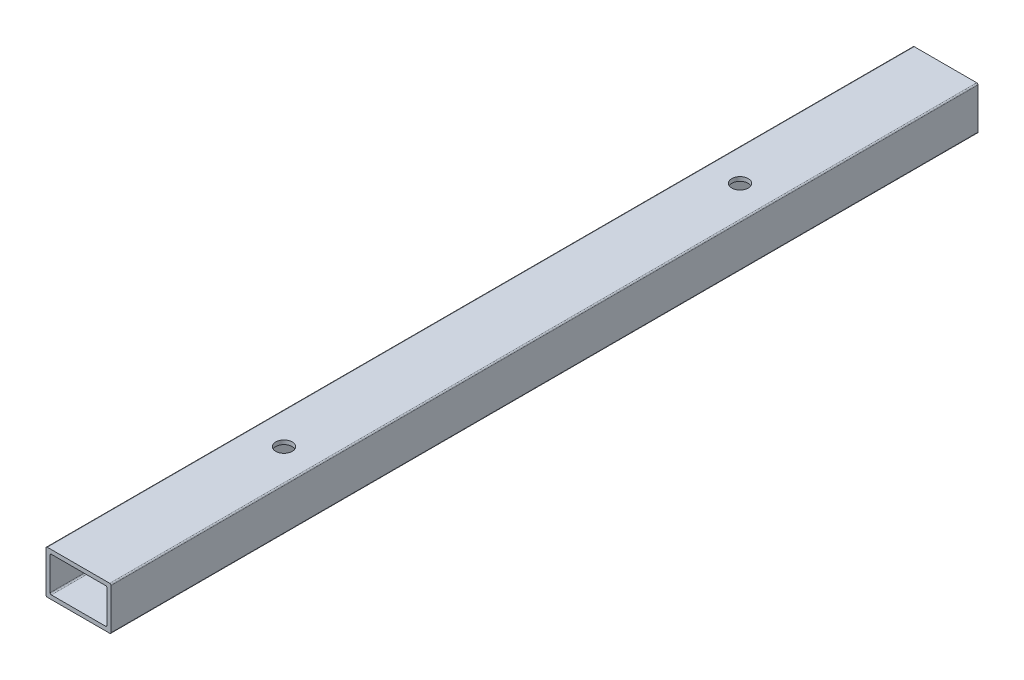
ISO-10303-21;
HEADER;
FILE_DESCRIPTION(('STEP AP214'),'2;1');
FILE_NAME('part.step','',(''),(''),'','','');
FILE_SCHEMA(('AUTOMOTIVE_DESIGN { 1 0 10303 214 1 1 1 1 }'));
ENDSEC;
DATA;
#1=APPLICATION_CONTEXT('core data for automotive mechanical design processes');
#2=APPLICATION_PROTOCOL_DEFINITION('international standard','automotive_design',2000,#1);
#3=PRODUCT_CONTEXT('',#1,'mechanical');
#4=PRODUCT('Part','Part','',(#3));
#5=PRODUCT_RELATED_PRODUCT_CATEGORY('part','',(#4));
#6=PRODUCT_DEFINITION_FORMATION('','',#4);
#7=PRODUCT_DEFINITION_CONTEXT('part definition',#1,'design');
#8=PRODUCT_DEFINITION('design','',#6,#7);
#9=PRODUCT_DEFINITION_SHAPE('','',#8);
#10=(LENGTH_UNIT() NAMED_UNIT(*) SI_UNIT(.MILLI.,.METRE.));
#11=(NAMED_UNIT(*) PLANE_ANGLE_UNIT() SI_UNIT($,.RADIAN.));
#12=(NAMED_UNIT(*) SI_UNIT($,.STERADIAN.) SOLID_ANGLE_UNIT());
#13=UNCERTAINTY_MEASURE_WITH_UNIT(LENGTH_MEASURE(1.E-05),#10,'distance_accuracy_value','');
#14=(GEOMETRIC_REPRESENTATION_CONTEXT(3) GLOBAL_UNCERTAINTY_ASSIGNED_CONTEXT((#13)) GLOBAL_UNIT_ASSIGNED_CONTEXT((#10,
#11,#12)) REPRESENTATION_CONTEXT('',''));
#15=CARTESIAN_POINT('',(0.,0.,0.));
#16=DIRECTION('',(0.,0.,1.));
#17=DIRECTION('',(1.,0.,0.));
#18=AXIS2_PLACEMENT_3D('',#15,#16,#17);
#19=CARTESIAN_POINT('',(-9.14400000000002,5.96899999999999,254.));
#20=DIRECTION('',(0.,0.,-1.));
#21=DIRECTION('',(-1.,0.,0.));
#22=AXIS2_PLACEMENT_3D('',#19,#20,#21);
#23=CYLINDRICAL_SURFACE('',#22,0.380999999999999);
#24=CARTESIAN_POINT('',(-9.14400000000002,5.96899999999999,254.));
#25=DIRECTION('',(0.,0.,-1.));
#26=DIRECTION('',(-1.,0.,0.));
#27=AXIS2_PLACEMENT_3D('',#24,#25,#26);
#28=CIRCLE('',#27,0.380999999999999);
#29=CARTESIAN_POINT('',(-9.52500000000002,5.96899999999999,254.));
#30=VERTEX_POINT('',#29);
#31=CARTESIAN_POINT('',(-9.14400000000002,6.34999999999999,254.));
#32=VERTEX_POINT('',#31);
#33=EDGE_CURVE('E135',#30,#32,#28,.T.);
#34=ORIENTED_EDGE('',*,*,#33,.T.);
#35=DIRECTION('',(0.,0.,-1.));
#36=VECTOR('',#35,1.);
#37=CARTESIAN_POINT('',(-9.14400000000002,6.34999999999999,254.));
#38=LINE('',#37,#36);
#39=CARTESIAN_POINT('',(-9.14400000000002,6.34999999999999,0.));
#40=VERTEX_POINT('',#39);
#41=EDGE_CURVE('E133',#32,#40,#38,.T.);
#42=ORIENTED_EDGE('',*,*,#41,.T.);
#43=CARTESIAN_POINT('',(-9.14400000000002,5.96899999999999,0.));
#44=DIRECTION('',(0.,0.,-1.));
#45=DIRECTION('',(-1.,0.,0.));
#46=AXIS2_PLACEMENT_3D('',#43,#44,#45);
#47=CIRCLE('',#46,0.380999999999999);
#48=CARTESIAN_POINT('',(-9.52500000000002,5.96899999999999,0.));
#49=VERTEX_POINT('',#48);
#50=EDGE_CURVE('E20',#40,#49,#47,.F.);
#51=ORIENTED_EDGE('',*,*,#50,.T.);
#52=DIRECTION('',(0.,0.,-1.));
#53=VECTOR('',#52,1.);
#54=CARTESIAN_POINT('',(-9.52500000000002,5.96899999999999,254.));
#55=LINE('',#54,#53);
#56=EDGE_CURVE('E130',#49,#30,#55,.F.);
#57=ORIENTED_EDGE('',*,*,#56,.T.);
#58=EDGE_LOOP('',(#34,#42,#51,#57));
#59=FACE_BOUND('',#58,.T.);
#60=ADVANCED_FACE('F17',(#59),#23,.T.);
#61=CARTESIAN_POINT('',(9.14399999999998,5.96899999999999,254.));
#62=DIRECTION('',(0.,0.,-1.));
#63=DIRECTION('',(-1.,0.,0.));
#64=AXIS2_PLACEMENT_3D('',#61,#62,#63);
#65=CYLINDRICAL_SURFACE('',#64,0.380999999999999);
#66=CARTESIAN_POINT('',(9.14399999999998,5.96899999999999,254.));
#67=DIRECTION('',(0.,0.,-1.));
#68=DIRECTION('',(-1.,0.,0.));
#69=AXIS2_PLACEMENT_3D('',#66,#67,#68);
#70=CIRCLE('',#69,0.380999999999999);
#71=CARTESIAN_POINT('',(9.14399999999998,6.34999999999999,254.));
#72=VERTEX_POINT('',#71);
#73=CARTESIAN_POINT('',(9.52499999999998,5.96899999999999,254.));
#74=VERTEX_POINT('',#73);
#75=EDGE_CURVE('E264',#72,#74,#70,.T.);
#76=ORIENTED_EDGE('',*,*,#75,.T.);
#77=DIRECTION('',(0.,0.,1.));
#78=VECTOR('',#77,1.);
#79=CARTESIAN_POINT('',(9.52499999999998,5.96899999999999,254.));
#80=LINE('',#79,#78);
#81=CARTESIAN_POINT('',(9.52499999999998,5.96899999999999,0.));
#82=VERTEX_POINT('',#81);
#83=EDGE_CURVE('E213',#74,#82,#80,.F.);
#84=ORIENTED_EDGE('',*,*,#83,.T.);
#85=CARTESIAN_POINT('',(9.14399999999998,5.96899999999999,0.));
#86=DIRECTION('',(0.,0.,-1.));
#87=DIRECTION('',(-1.,0.,0.));
#88=AXIS2_PLACEMENT_3D('',#85,#86,#87);
#89=CIRCLE('',#88,0.380999999999999);
#90=CARTESIAN_POINT('',(9.14399999999998,6.34999999999999,0.));
#91=VERTEX_POINT('',#90);
#92=EDGE_CURVE('E266',#82,#91,#89,.F.);
#93=ORIENTED_EDGE('',*,*,#92,.T.);
#94=DIRECTION('',(0.,0.,-1.));
#95=VECTOR('',#94,1.);
#96=CARTESIAN_POINT('',(9.14399999999998,6.34999999999999,254.));
#97=LINE('',#96,#95);
#98=EDGE_CURVE('E220',#91,#72,#97,.F.);
#99=ORIENTED_EDGE('',*,*,#98,.T.);
#100=EDGE_LOOP('',(#76,#84,#93,#99));
#101=FACE_BOUND('',#100,.T.);
#102=ADVANCED_FACE('F278',(#101),#65,.T.);
#103=CARTESIAN_POINT('',(-7.95020000000002,-4.7752,254.));
#104=DIRECTION('',(0.,0.,-1.));
#105=DIRECTION('',(-1.,0.,0.));
#106=AXIS2_PLACEMENT_3D('',#103,#104,#105);
#107=CYLINDRICAL_SURFACE('',#106,0.380999999999999);
#108=DIRECTION('',(0.,0.,-1.));
#109=VECTOR('',#108,1.);
#110=CARTESIAN_POINT('',(-8.33120000000002,-4.7752,254.));
#111=LINE('',#110,#109);
#112=CARTESIAN_POINT('',(-8.33120000000002,-4.7752,254.));
#113=VERTEX_POINT('',#112);
#114=CARTESIAN_POINT('',(-8.33120000000002,-4.7752,0.));
#115=VERTEX_POINT('',#114);
#116=EDGE_CURVE('E207',#113,#115,#111,.T.);
#117=ORIENTED_EDGE('',*,*,#116,.F.);
#118=CARTESIAN_POINT('',(-7.95020000000002,-4.7752,254.));
#119=DIRECTION('',(0.,0.,-1.));
#120=DIRECTION('',(-1.,0.,0.));
#121=AXIS2_PLACEMENT_3D('',#118,#119,#120);
#122=CIRCLE('',#121,0.380999999999999);
#123=CARTESIAN_POINT('',(-7.95020000000002,-5.1562,254.));
#124=VERTEX_POINT('',#123);
#125=EDGE_CURVE('E262',#124,#113,#122,.T.);
#126=ORIENTED_EDGE('',*,*,#125,.F.);
#127=DIRECTION('',(0.,0.,1.));
#128=VECTOR('',#127,1.);
#129=CARTESIAN_POINT('',(-7.95020000000002,-5.1562,254.));
#130=LINE('',#129,#128);
#131=CARTESIAN_POINT('',(-7.95020000000002,-5.1562,0.));
#132=VERTEX_POINT('',#131);
#133=EDGE_CURVE('E204',#132,#124,#130,.T.);
#134=ORIENTED_EDGE('',*,*,#133,.F.);
#135=CARTESIAN_POINT('',(-7.95020000000002,-4.7752,0.));
#136=DIRECTION('',(0.,0.,-1.));
#137=DIRECTION('',(-1.,0.,0.));
#138=AXIS2_PLACEMENT_3D('',#135,#136,#137);
#139=CIRCLE('',#138,0.380999999999999);
#140=EDGE_CURVE('E260',#115,#132,#139,.F.);
#141=ORIENTED_EDGE('',*,*,#140,.F.);
#142=EDGE_LOOP('',(#117,#126,#134,#141));
#143=FACE_BOUND('',#142,.T.);
#144=ADVANCED_FACE('F312',(#143),#107,.F.);
#145=CARTESIAN_POINT('',(7.95019999999998,-4.7752,254.));
#146=DIRECTION('',(0.,0.,-1.));
#147=DIRECTION('',(-1.,0.,0.));
#148=AXIS2_PLACEMENT_3D('',#145,#146,#147);
#149=CYLINDRICAL_SURFACE('',#148,0.380999999999999);
#150=DIRECTION('',(0.,0.,1.));
#151=VECTOR('',#150,1.);
#152=CARTESIAN_POINT('',(7.95019999999997,-5.1562,254.));
#153=LINE('',#152,#151);
#154=CARTESIAN_POINT('',(7.95019999999997,-5.1562,254.));
#155=VERTEX_POINT('',#154);
#156=CARTESIAN_POINT('',(7.95019999999997,-5.1562,0.));
#157=VERTEX_POINT('',#156);
#158=EDGE_CURVE('E200',#155,#157,#153,.F.);
#159=ORIENTED_EDGE('',*,*,#158,.F.);
#160=CARTESIAN_POINT('',(7.95019999999998,-4.7752,254.));
#161=DIRECTION('',(0.,0.,-1.));
#162=DIRECTION('',(-1.,0.,0.));
#163=AXIS2_PLACEMENT_3D('',#160,#161,#162);
#164=CIRCLE('',#163,0.380999999999999);
#165=CARTESIAN_POINT('',(8.33119999999998,-4.7752,254.));
#166=VERTEX_POINT('',#165);
#167=EDGE_CURVE('E258',#166,#155,#164,.T.);
#168=ORIENTED_EDGE('',*,*,#167,.F.);
#169=DIRECTION('',(0.,0.,1.));
#170=VECTOR('',#169,1.);
#171=CARTESIAN_POINT('',(8.33119999999998,-4.7752,254.));
#172=LINE('',#171,#170);
#173=CARTESIAN_POINT('',(8.33119999999998,-4.7752,0.));
#174=VERTEX_POINT('',#173);
#175=EDGE_CURVE('E196',#174,#166,#172,.T.);
#176=ORIENTED_EDGE('',*,*,#175,.F.);
#177=CARTESIAN_POINT('',(7.95019999999998,-4.7752,0.));
#178=DIRECTION('',(0.,0.,-1.));
#179=DIRECTION('',(-1.,0.,0.));
#180=AXIS2_PLACEMENT_3D('',#177,#178,#179);
#181=CIRCLE('',#180,0.380999999999999);
#182=EDGE_CURVE('E256',#157,#174,#181,.F.);
#183=ORIENTED_EDGE('',*,*,#182,.F.);
#184=EDGE_LOOP('',(#159,#168,#176,#183));
#185=FACE_BOUND('',#184,.T.);
#186=ADVANCED_FACE('F319',(#185),#149,.F.);
#187=CARTESIAN_POINT('',(0.,-6.35000000000001,193.802));
#188=DIRECTION('',(0.,1.,0.));
#189=DIRECTION('',(0.,0.,1.));
#190=AXIS2_PLACEMENT_3D('',#187,#188,#189);
#191=CYLINDRICAL_SURFACE('',#190,2.413);
#192=CARTESIAN_POINT('',(0.,5.1562,193.802));
#193=DIRECTION('',(0.,1.,0.));
#194=DIRECTION('',(0.,0.,1.));
#195=AXIS2_PLACEMENT_3D('',#192,#193,#194);
#196=CIRCLE('',#195,2.413);
#197=CARTESIAN_POINT('',(0.,5.1562,196.215));
#198=VERTEX_POINT('',#197);
#199=EDGE_CURVE('E203',#198,#198,#196,.T.);
#200=ORIENTED_EDGE('',*,*,#199,.F.);
#201=EDGE_LOOP('',(#200));
#202=FACE_BOUND('',#201,.T.);
#203=CARTESIAN_POINT('',(0.,6.34999999999999,193.802));
#204=DIRECTION('',(0.,1.,0.));
#205=DIRECTION('',(0.,0.,1.));
#206=AXIS2_PLACEMENT_3D('',#203,#204,#205);
#207=CIRCLE('',#206,2.413);
#208=CARTESIAN_POINT('',(0.,6.34999999999999,196.215));
#209=VERTEX_POINT('',#208);
#210=EDGE_CURVE('E142',#209,#209,#207,.T.);
#211=ORIENTED_EDGE('',*,*,#210,.T.);
#212=EDGE_LOOP('',(#211));
#213=FACE_BOUND('',#212,.T.);
#214=ADVANCED_FACE('F387',(#202,#213),#191,.F.);
#215=CARTESIAN_POINT('',(0.,-6.35000000000001,60.198));
#216=DIRECTION('',(0.,1.,0.));
#217=DIRECTION('',(0.,0.,1.));
#218=AXIS2_PLACEMENT_3D('',#215,#216,#217);
#219=CYLINDRICAL_SURFACE('',#218,2.413);
#220=CARTESIAN_POINT('',(0.,5.1562,60.198));
#221=DIRECTION('',(0.,1.,0.));
#222=DIRECTION('',(0.,0.,1.));
#223=AXIS2_PLACEMENT_3D('',#220,#221,#222);
#224=CIRCLE('',#223,2.413);
#225=CARTESIAN_POINT('',(0.,5.1562,62.611));
#226=VERTEX_POINT('',#225);
#227=EDGE_CURVE('E192',#226,#226,#224,.T.);
#228=ORIENTED_EDGE('',*,*,#227,.F.);
#229=EDGE_LOOP('',(#228));
#230=FACE_BOUND('',#229,.T.);
#231=CARTESIAN_POINT('',(0.,6.34999999999999,60.198));
#232=DIRECTION('',(0.,1.,0.));
#233=DIRECTION('',(0.,0.,1.));
#234=AXIS2_PLACEMENT_3D('',#231,#232,#233);
#235=CIRCLE('',#234,2.413);
#236=CARTESIAN_POINT('',(0.,6.34999999999999,62.611));
#237=VERTEX_POINT('',#236);
#238=EDGE_CURVE('E222',#237,#237,#235,.T.);
#239=ORIENTED_EDGE('',*,*,#238,.T.);
#240=EDGE_LOOP('',(#239));
#241=FACE_BOUND('',#240,.T.);
#242=ADVANCED_FACE('F384',(#230,#241),#219,.F.);
#243=CARTESIAN_POINT('',(7.95019999999998,4.77519999999999,254.));
#244=DIRECTION('',(0.,0.,-1.));
#245=DIRECTION('',(-1.,0.,0.));
#246=AXIS2_PLACEMENT_3D('',#243,#244,#245);
#247=CYLINDRICAL_SURFACE('',#246,0.380999999999999);
#248=DIRECTION('',(0.,0.,1.));
#249=VECTOR('',#248,1.);
#250=CARTESIAN_POINT('',(8.33119999999998,4.77519999999999,254.));
#251=LINE('',#250,#249);
#252=CARTESIAN_POINT('',(8.33119999999998,4.77519999999999,254.));
#253=VERTEX_POINT('',#252);
#254=CARTESIAN_POINT('',(8.33119999999998,4.77519999999999,0.));
#255=VERTEX_POINT('',#254);
#256=EDGE_CURVE('E199',#253,#255,#251,.F.);
#257=ORIENTED_EDGE('',*,*,#256,.F.);
#258=CARTESIAN_POINT('',(7.95019999999998,4.77519999999999,254.));
#259=DIRECTION('',(0.,0.,-1.));
#260=DIRECTION('',(-1.,0.,0.));
#261=AXIS2_PLACEMENT_3D('',#258,#259,#260);
#262=CIRCLE('',#261,0.380999999999999);
#263=CARTESIAN_POINT('',(7.95019999999998,5.15619999999999,254.));
#264=VERTEX_POINT('',#263);
#265=EDGE_CURVE('E254',#264,#253,#262,.T.);
#266=ORIENTED_EDGE('',*,*,#265,.F.);
#267=DIRECTION('',(0.,0.,-1.));
#268=VECTOR('',#267,1.);
#269=CARTESIAN_POINT('',(7.95019999999997,5.15619999999999,254.));
#270=LINE('',#269,#268);
#271=CARTESIAN_POINT('',(7.95019999999998,5.15619999999999,0.));
#272=VERTEX_POINT('',#271);
#273=EDGE_CURVE('E188',#272,#264,#270,.F.);
#274=ORIENTED_EDGE('',*,*,#273,.F.);
#275=CARTESIAN_POINT('',(7.95019999999998,4.77519999999999,0.));
#276=DIRECTION('',(0.,0.,-1.));
#277=DIRECTION('',(-1.,0.,0.));
#278=AXIS2_PLACEMENT_3D('',#275,#276,#277);
#279=CIRCLE('',#278,0.380999999999999);
#280=EDGE_CURVE('E252',#255,#272,#279,.F.);
#281=ORIENTED_EDGE('',*,*,#280,.F.);
#282=EDGE_LOOP('',(#257,#266,#274,#281));
#283=FACE_BOUND('',#282,.T.);
#284=ADVANCED_FACE('F327',(#283),#247,.F.);
#285=CARTESIAN_POINT('',(-7.95020000000002,4.77519999999999,254.));
#286=DIRECTION('',(0.,0.,-1.));
#287=DIRECTION('',(-1.,0.,0.));
#288=AXIS2_PLACEMENT_3D('',#285,#286,#287);
#289=CYLINDRICAL_SURFACE('',#288,0.380999999999999);
#290=DIRECTION('',(0.,0.,-1.));
#291=VECTOR('',#290,1.);
#292=CARTESIAN_POINT('',(-7.95020000000002,5.15619999999999,254.));
#293=LINE('',#292,#291);
#294=CARTESIAN_POINT('',(-7.95020000000002,5.15619999999999,254.));
#295=VERTEX_POINT('',#294);
#296=CARTESIAN_POINT('',(-7.95020000000002,5.15619999999999,0.));
#297=VERTEX_POINT('',#296);
#298=EDGE_CURVE('E191',#295,#297,#293,.T.);
#299=ORIENTED_EDGE('',*,*,#298,.F.);
#300=CARTESIAN_POINT('',(-7.95020000000002,4.77519999999999,254.));
#301=DIRECTION('',(0.,0.,-1.));
#302=DIRECTION('',(-1.,0.,0.));
#303=AXIS2_PLACEMENT_3D('',#300,#301,#302);
#304=CIRCLE('',#303,0.380999999999999);
#305=CARTESIAN_POINT('',(-8.33120000000002,4.77519999999999,254.));
#306=VERTEX_POINT('',#305);
#307=EDGE_CURVE('E250',#306,#295,#304,.T.);
#308=ORIENTED_EDGE('',*,*,#307,.F.);
#309=DIRECTION('',(0.,0.,-1.));
#310=VECTOR('',#309,1.);
#311=CARTESIAN_POINT('',(-8.33120000000002,4.77519999999999,254.));
#312=LINE('',#311,#310);
#313=CARTESIAN_POINT('',(-8.33120000000002,4.77519999999999,0.));
#314=VERTEX_POINT('',#313);
#315=EDGE_CURVE('E210',#314,#306,#312,.F.);
#316=ORIENTED_EDGE('',*,*,#315,.F.);
#317=CARTESIAN_POINT('',(-7.95020000000002,4.77519999999999,0.));
#318=DIRECTION('',(0.,0.,-1.));
#319=DIRECTION('',(-1.,0.,0.));
#320=AXIS2_PLACEMENT_3D('',#317,#318,#319);
#321=CIRCLE('',#320,0.380999999999999);
#322=EDGE_CURVE('E143',#297,#314,#321,.F.);
#323=ORIENTED_EDGE('',*,*,#322,.F.);
#324=EDGE_LOOP('',(#299,#308,#316,#323));
#325=FACE_BOUND('',#324,.T.);
#326=ADVANCED_FACE('F303',(#325),#289,.F.);
#327=CARTESIAN_POINT('',(-9.52500000000002,-5.969,254.));
#328=DIRECTION('',(1.,0.,0.));
#329=DIRECTION('',(0.,0.,-1.));
#330=AXIS2_PLACEMENT_3D('',#327,#328,#329);
#331=PLANE('',#330);
#332=DIRECTION('',(0.,0.,-1.));
#333=VECTOR('',#332,1.);
#334=CARTESIAN_POINT('',(-9.52500000000002,-5.969,254.));
#335=LINE('',#334,#333);
#336=CARTESIAN_POINT('',(-9.52500000000002,-5.969,254.));
#337=VERTEX_POINT('',#336);
#338=CARTESIAN_POINT('',(-9.52500000000002,-5.969,0.));
#339=VERTEX_POINT('',#338);
#340=EDGE_CURVE('E187',#337,#339,#335,.T.);
#341=ORIENTED_EDGE('',*,*,#340,.F.);
#342=DIRECTION('',(0.,1.,0.));
#343=VECTOR('',#342,1.);
#344=CARTESIAN_POINT('',(-9.52500000000002,-5.969,254.));
#345=LINE('',#344,#343);
#346=EDGE_CURVE('E141',#337,#30,#345,.T.);
#347=ORIENTED_EDGE('',*,*,#346,.T.);
#348=ORIENTED_EDGE('',*,*,#56,.F.);
#349=DIRECTION('',(0.,1.,0.));
#350=VECTOR('',#349,1.);
#351=CARTESIAN_POINT('',(-9.52500000000002,-5.969,0.));
#352=LINE('',#351,#350);
#353=EDGE_CURVE('E140',#339,#49,#352,.T.);
#354=ORIENTED_EDGE('',*,*,#353,.F.);
#355=EDGE_LOOP('',(#341,#347,#348,#354));
#356=FACE_BOUND('',#355,.T.);
#357=ADVANCED_FACE('F139',(#356),#331,.F.);
#358=CARTESIAN_POINT('',(-9.14400000000002,6.34999999999999,254.));
#359=DIRECTION('',(0.,-1.,0.));
#360=DIRECTION('',(0.,0.,-1.));
#361=AXIS2_PLACEMENT_3D('',#358,#359,#360);
#362=PLANE('',#361);
#363=ORIENTED_EDGE('',*,*,#41,.F.);
#364=DIRECTION('',(-1.,0.,0.));
#365=VECTOR('',#364,1.);
#366=CARTESIAN_POINT('',(-9.14400000000002,6.35,254.));
#367=LINE('',#366,#365);
#368=EDGE_CURVE('E183',#32,#72,#367,.F.);
#369=ORIENTED_EDGE('',*,*,#368,.T.);
#370=ORIENTED_EDGE('',*,*,#98,.F.);
#371=DIRECTION('',(-1.,0.,0.));
#372=VECTOR('',#371,1.);
#373=CARTESIAN_POINT('',(-9.14400000000002,6.35,0.));
#374=LINE('',#373,#372);
#375=EDGE_CURVE('E149',#40,#91,#374,.F.);
#376=ORIENTED_EDGE('',*,*,#375,.F.);
#377=EDGE_LOOP('',(#363,#369,#370,#376));
#378=FACE_BOUND('',#377,.T.);
#379=ORIENTED_EDGE('',*,*,#238,.F.);
#380=EDGE_LOOP('',(#379));
#381=FACE_BOUND('',#380,.T.);
#382=ORIENTED_EDGE('',*,*,#210,.F.);
#383=EDGE_LOOP('',(#382));
#384=FACE_BOUND('',#383,.T.);
#385=ADVANCED_FACE('F270',(#378,#381,#384),#362,.F.);
#386=CARTESIAN_POINT('',(9.52499999999998,-5.969,254.));
#387=DIRECTION('',(-1.,0.,0.));
#388=DIRECTION('',(0.,0.,1.));
#389=AXIS2_PLACEMENT_3D('',#386,#387,#388);
#390=PLANE('',#389);
#391=ORIENTED_EDGE('',*,*,#83,.F.);
#392=DIRECTION('',(0.,1.,0.));
#393=VECTOR('',#392,1.);
#394=CARTESIAN_POINT('',(9.52499999999998,-5.969,254.));
#395=LINE('',#394,#393);
#396=CARTESIAN_POINT('',(9.52499999999998,-5.969,254.));
#397=VERTEX_POINT('',#396);
#398=EDGE_CURVE('E180',#74,#397,#395,.F.);
#399=ORIENTED_EDGE('',*,*,#398,.T.);
#400=DIRECTION('',(0.,0.,-1.));
#401=VECTOR('',#400,1.);
#402=CARTESIAN_POINT('',(9.52499999999998,-5.969,254.));
#403=LINE('',#402,#401);
#404=CARTESIAN_POINT('',(9.52499999999998,-5.969,0.));
#405=VERTEX_POINT('',#404);
#406=EDGE_CURVE('E169',#405,#397,#403,.F.);
#407=ORIENTED_EDGE('',*,*,#406,.F.);
#408=DIRECTION('',(0.,1.,0.));
#409=VECTOR('',#408,1.);
#410=CARTESIAN_POINT('',(9.52499999999998,-5.969,0.));
#411=LINE('',#410,#409);
#412=EDGE_CURVE('E151',#82,#405,#411,.F.);
#413=ORIENTED_EDGE('',*,*,#412,.F.);
#414=EDGE_LOOP('',(#391,#399,#407,#413));
#415=FACE_BOUND('',#414,.T.);
#416=ADVANCED_FACE('F282',(#415),#390,.F.);
#417=CARTESIAN_POINT('',(-8.33120000000002,-4.7752,254.));
#418=DIRECTION('',(1.,0.,0.));
#419=DIRECTION('',(0.,0.,-1.));
#420=AXIS2_PLACEMENT_3D('',#417,#418,#419);
#421=PLANE('',#420);
#422=DIRECTION('',(0.,1.,0.));
#423=VECTOR('',#422,1.);
#424=CARTESIAN_POINT('',(-8.33120000000002,-5.969,254.));
#425=LINE('',#424,#423);
#426=EDGE_CURVE('E166',#306,#113,#425,.F.);
#427=ORIENTED_EDGE('',*,*,#426,.T.);
#428=ORIENTED_EDGE('',*,*,#116,.T.);
#429=DIRECTION('',(0.,1.,0.));
#430=VECTOR('',#429,1.);
#431=CARTESIAN_POINT('',(-8.33120000000002,-5.969,0.));
#432=LINE('',#431,#430);
#433=EDGE_CURVE('E232',#314,#115,#432,.F.);
#434=ORIENTED_EDGE('',*,*,#433,.F.);
#435=ORIENTED_EDGE('',*,*,#315,.T.);
#436=EDGE_LOOP('',(#427,#428,#434,#435));
#437=FACE_BOUND('',#436,.T.);
#438=ADVANCED_FACE('F307',(#437),#421,.T.);
#439=CARTESIAN_POINT('',(-7.95020000000002,-5.1562,254.));
#440=DIRECTION('',(0.,1.,0.));
#441=DIRECTION('',(0.,0.,1.));
#442=AXIS2_PLACEMENT_3D('',#439,#440,#441);
#443=PLANE('',#442);
#444=DIRECTION('',(-1.,0.,0.));
#445=VECTOR('',#444,1.);
#446=CARTESIAN_POINT('',(-9.14400000000002,-5.1562,254.));
#447=LINE('',#446,#445);
#448=EDGE_CURVE('E176',#124,#155,#447,.F.);
#449=ORIENTED_EDGE('',*,*,#448,.T.);
#450=ORIENTED_EDGE('',*,*,#158,.T.);
#451=DIRECTION('',(-1.,0.,0.));
#452=VECTOR('',#451,1.);
#453=CARTESIAN_POINT('',(-9.14400000000002,-5.1562,0.));
#454=LINE('',#453,#452);
#455=EDGE_CURVE('E286',#132,#157,#454,.F.);
#456=ORIENTED_EDGE('',*,*,#455,.F.);
#457=ORIENTED_EDGE('',*,*,#133,.T.);
#458=EDGE_LOOP('',(#449,#450,#456,#457));
#459=FACE_BOUND('',#458,.T.);
#460=CARTESIAN_POINT('',(0.,-5.1562,60.198));
#461=DIRECTION('',(0.,1.,0.));
#462=DIRECTION('',(0.,0.,1.));
#463=AXIS2_PLACEMENT_3D('',#460,#461,#462);
#464=CIRCLE('',#463,2.413);
#465=CARTESIAN_POINT('',(0.,-5.1562,62.611));
#466=VERTEX_POINT('',#465);
#467=EDGE_CURVE('E225',#466,#466,#464,.F.);
#468=ORIENTED_EDGE('',*,*,#467,.T.);
#469=EDGE_LOOP('',(#468));
#470=FACE_BOUND('',#469,.T.);
#471=CARTESIAN_POINT('',(0.,-5.1562,193.802));
#472=DIRECTION('',(0.,1.,0.));
#473=DIRECTION('',(0.,0.,1.));
#474=AXIS2_PLACEMENT_3D('',#471,#472,#473);
#475=CIRCLE('',#474,2.413);
#476=CARTESIAN_POINT('',(0.,-5.1562,196.215));
#477=VERTEX_POINT('',#476);
#478=EDGE_CURVE('E195',#477,#477,#475,.F.);
#479=ORIENTED_EDGE('',*,*,#478,.T.);
#480=EDGE_LOOP('',(#479));
#481=FACE_BOUND('',#480,.T.);
#482=ADVANCED_FACE('F315',(#459,#470,#481),#443,.T.);
#483=CARTESIAN_POINT('',(8.33119999999998,-4.7752,254.));
#484=DIRECTION('',(-1.,0.,0.));
#485=DIRECTION('',(0.,-1.,0.));
#486=AXIS2_PLACEMENT_3D('',#483,#484,#485);
#487=PLANE('',#486);
#488=DIRECTION('',(0.,1.,0.));
#489=VECTOR('',#488,1.);
#490=CARTESIAN_POINT('',(8.33119999999998,-5.969,254.));
#491=LINE('',#490,#489);
#492=EDGE_CURVE('E173',#166,#253,#491,.T.);
#493=ORIENTED_EDGE('',*,*,#492,.T.);
#494=ORIENTED_EDGE('',*,*,#256,.T.);
#495=DIRECTION('',(0.,1.,0.));
#496=VECTOR('',#495,1.);
#497=CARTESIAN_POINT('',(8.33119999999998,-5.969,0.));
#498=LINE('',#497,#496);
#499=EDGE_CURVE('E289',#174,#255,#498,.T.);
#500=ORIENTED_EDGE('',*,*,#499,.F.);
#501=ORIENTED_EDGE('',*,*,#175,.T.);
#502=EDGE_LOOP('',(#493,#494,#500,#501));
#503=FACE_BOUND('',#502,.T.);
#504=ADVANCED_FACE('F323',(#503),#487,.T.);
#505=CARTESIAN_POINT('',(-7.95020000000002,5.15619999999999,254.));
#506=DIRECTION('',(0.,-1.,0.));
#507=DIRECTION('',(0.,0.,-1.));
#508=AXIS2_PLACEMENT_3D('',#505,#506,#507);
#509=PLANE('',#508);
#510=DIRECTION('',(-1.,0.,0.));
#511=VECTOR('',#510,1.);
#512=CARTESIAN_POINT('',(-9.14400000000002,5.15619999999999,254.));
#513=LINE('',#512,#511);
#514=EDGE_CURVE('E170',#264,#295,#513,.T.);
#515=ORIENTED_EDGE('',*,*,#514,.T.);
#516=ORIENTED_EDGE('',*,*,#298,.T.);
#517=DIRECTION('',(-1.,0.,0.));
#518=VECTOR('',#517,1.);
#519=CARTESIAN_POINT('',(-9.14400000000002,5.15619999999999,0.));
#520=LINE('',#519,#518);
#521=EDGE_CURVE('E231',#272,#297,#520,.T.);
#522=ORIENTED_EDGE('',*,*,#521,.F.);
#523=ORIENTED_EDGE('',*,*,#273,.T.);
#524=EDGE_LOOP('',(#515,#516,#522,#523));
#525=FACE_BOUND('',#524,.T.);
#526=ORIENTED_EDGE('',*,*,#227,.T.);
#527=EDGE_LOOP('',(#526));
#528=FACE_BOUND('',#527,.T.);
#529=ORIENTED_EDGE('',*,*,#199,.T.);
#530=EDGE_LOOP('',(#529));
#531=FACE_BOUND('',#530,.T.);
#532=ADVANCED_FACE('F298',(#525,#528,#531),#509,.T.);
#533=CARTESIAN_POINT('',(0.,-6.35000000000001,193.802));
#534=DIRECTION('',(0.,1.,0.));
#535=DIRECTION('',(0.,0.,1.));
#536=AXIS2_PLACEMENT_3D('',#533,#534,#535);
#537=CYLINDRICAL_SURFACE('',#536,2.413);
#538=CARTESIAN_POINT('',(0.,-6.35000000000001,193.802));
#539=DIRECTION('',(0.,1.,0.));
#540=DIRECTION('',(0.,0.,1.));
#541=AXIS2_PLACEMENT_3D('',#538,#539,#540);
#542=CIRCLE('',#541,2.413);
#543=CARTESIAN_POINT('',(0.,-6.35000000000001,196.215));
#544=VERTEX_POINT('',#543);
#545=EDGE_CURVE('E228',#544,#544,#542,.F.);
#546=ORIENTED_EDGE('',*,*,#545,.T.);
#547=EDGE_LOOP('',(#546));
#548=FACE_BOUND('',#547,.T.);
#549=ORIENTED_EDGE('',*,*,#478,.F.);
#550=EDGE_LOOP('',(#549));
#551=FACE_BOUND('',#550,.T.);
#552=ADVANCED_FACE('F358',(#548,#551),#537,.F.);
#553=CARTESIAN_POINT('',(0.,-6.35000000000001,60.198));
#554=DIRECTION('',(0.,1.,0.));
#555=DIRECTION('',(0.,0.,1.));
#556=AXIS2_PLACEMENT_3D('',#553,#554,#555);
#557=CYLINDRICAL_SURFACE('',#556,2.413);
#558=CARTESIAN_POINT('',(0.,-6.35000000000001,60.198));
#559=DIRECTION('',(0.,1.,0.));
#560=DIRECTION('',(0.,0.,1.));
#561=AXIS2_PLACEMENT_3D('',#558,#559,#560);
#562=CIRCLE('',#561,2.413);
#563=CARTESIAN_POINT('',(0.,-6.35000000000001,62.611));
#564=VERTEX_POINT('',#563);
#565=EDGE_CURVE('E163',#564,#564,#562,.F.);
#566=ORIENTED_EDGE('',*,*,#565,.T.);
#567=EDGE_LOOP('',(#566));
#568=FACE_BOUND('',#567,.T.);
#569=ORIENTED_EDGE('',*,*,#467,.F.);
#570=EDGE_LOOP('',(#569));
#571=FACE_BOUND('',#570,.T.);
#572=ADVANCED_FACE('F340',(#568,#571),#557,.F.);
#573=CARTESIAN_POINT('',(-9.14400000000002,-5.969,254.));
#574=DIRECTION('',(0.,0.,-1.));
#575=DIRECTION('',(-1.,0.,0.));
#576=AXIS2_PLACEMENT_3D('',#573,#574,#575);
#577=CYLINDRICAL_SURFACE('',#576,0.380999999999999);
#578=CARTESIAN_POINT('',(-9.14400000000002,-5.969,254.));
#579=DIRECTION('',(0.,0.,-1.));
#580=DIRECTION('',(-1.,0.,0.));
#581=AXIS2_PLACEMENT_3D('',#578,#579,#580);
#582=CIRCLE('',#581,0.380999999999999);
#583=CARTESIAN_POINT('',(-9.14400000000002,-6.35000000000001,254.));
#584=VERTEX_POINT('',#583);
#585=EDGE_CURVE('E179',#584,#337,#582,.T.);
#586=ORIENTED_EDGE('',*,*,#585,.T.);
#587=ORIENTED_EDGE('',*,*,#340,.T.);
#588=CARTESIAN_POINT('',(-9.14400000000002,-5.969,0.));
#589=DIRECTION('',(0.,0.,-1.));
#590=DIRECTION('',(-1.,0.,0.));
#591=AXIS2_PLACEMENT_3D('',#588,#589,#590);
#592=CIRCLE('',#591,0.380999999999999);
#593=CARTESIAN_POINT('',(-9.14400000000002,-6.35000000000001,0.));
#594=VERTEX_POINT('',#593);
#595=EDGE_CURVE('E148',#594,#339,#592,.T.);
#596=ORIENTED_EDGE('',*,*,#595,.F.);
#597=DIRECTION('',(0.,0.,1.));
#598=VECTOR('',#597,1.);
#599=CARTESIAN_POINT('',(-9.14400000000002,-6.35000000000001,254.));
#600=LINE('',#599,#598);
#601=EDGE_CURVE('E160',#594,#584,#600,.T.);
#602=ORIENTED_EDGE('',*,*,#601,.T.);
#603=EDGE_LOOP('',(#586,#587,#596,#602));
#604=FACE_BOUND('',#603,.T.);
#605=ADVANCED_FACE('F331',(#604),#577,.T.);
#606=CARTESIAN_POINT('',(-9.14400000000002,-5.969,254.));
#607=DIRECTION('',(0.,0.,-1.));
#608=DIRECTION('',(-1.,0.,0.));
#609=AXIS2_PLACEMENT_3D('',#606,#607,#608);
#610=PLANE('',#609);
#611=ORIENTED_EDGE('',*,*,#426,.F.);
#612=ORIENTED_EDGE('',*,*,#307,.T.);
#613=ORIENTED_EDGE('',*,*,#514,.F.);
#614=ORIENTED_EDGE('',*,*,#265,.T.);
#615=ORIENTED_EDGE('',*,*,#492,.F.);
#616=ORIENTED_EDGE('',*,*,#167,.T.);
#617=ORIENTED_EDGE('',*,*,#448,.F.);
#618=ORIENTED_EDGE('',*,*,#125,.T.);
#619=EDGE_LOOP('',(#611,#612,#613,#614,#615,#616,#617,#618));
#620=FACE_BOUND('',#619,.T.);
#621=DIRECTION('',(1.,0.,0.));
#622=VECTOR('',#621,1.);
#623=CARTESIAN_POINT('',(-9.14400000000002,-6.35000000000001,254.));
#624=LINE('',#623,#622);
#625=CARTESIAN_POINT('',(9.14399999999998,-6.35000000000001,254.));
#626=VERTEX_POINT('',#625);
#627=EDGE_CURVE('E158',#584,#626,#624,.T.);
#628=ORIENTED_EDGE('',*,*,#627,.T.);
#629=CARTESIAN_POINT('',(9.14399999999998,-5.969,254.));
#630=DIRECTION('',(0.,0.,-1.));
#631=DIRECTION('',(-1.,0.,0.));
#632=AXIS2_PLACEMENT_3D('',#629,#630,#631);
#633=CIRCLE('',#632,0.380999999999999);
#634=EDGE_CURVE('E153',#397,#626,#633,.T.);
#635=ORIENTED_EDGE('',*,*,#634,.F.);
#636=ORIENTED_EDGE('',*,*,#398,.F.);
#637=ORIENTED_EDGE('',*,*,#75,.F.);
#638=ORIENTED_EDGE('',*,*,#368,.F.);
#639=ORIENTED_EDGE('',*,*,#33,.F.);
#640=ORIENTED_EDGE('',*,*,#346,.F.);
#641=ORIENTED_EDGE('',*,*,#585,.F.);
#642=EDGE_LOOP('',(#628,#635,#636,#637,#638,#639,#640,#641));
#643=FACE_BOUND('',#642,.T.);
#644=ADVANCED_FACE('F273',(#620,#643),#610,.F.);
#645=CARTESIAN_POINT('',(9.14399999999998,-5.969,254.));
#646=DIRECTION('',(0.,0.,-1.));
#647=DIRECTION('',(-1.,0.,0.));
#648=AXIS2_PLACEMENT_3D('',#645,#646,#647);
#649=CYLINDRICAL_SURFACE('',#648,0.380999999999999);
#650=ORIENTED_EDGE('',*,*,#634,.T.);
#651=DIRECTION('',(0.,0.,1.));
#652=VECTOR('',#651,1.);
#653=CARTESIAN_POINT('',(9.14399999999998,-6.35000000000001,254.));
#654=LINE('',#653,#652);
#655=CARTESIAN_POINT('',(9.14399999999998,-6.35000000000001,0.));
#656=VERTEX_POINT('',#655);
#657=EDGE_CURVE('E26',#626,#656,#654,.F.);
#658=ORIENTED_EDGE('',*,*,#657,.T.);
#659=CARTESIAN_POINT('',(9.14399999999998,-5.969,0.));
#660=DIRECTION('',(0.,0.,-1.));
#661=DIRECTION('',(-1.,0.,0.));
#662=AXIS2_PLACEMENT_3D('',#659,#660,#661);
#663=CIRCLE('',#662,0.380999999999999);
#664=EDGE_CURVE('E34',#405,#656,#663,.T.);
#665=ORIENTED_EDGE('',*,*,#664,.F.);
#666=ORIENTED_EDGE('',*,*,#406,.T.);
#667=EDGE_LOOP('',(#650,#658,#665,#666));
#668=FACE_BOUND('',#667,.T.);
#669=ADVANCED_FACE('F330',(#668),#649,.T.);
#670=CARTESIAN_POINT('',(-9.14400000000002,-5.969,0.));
#671=DIRECTION('',(0.,0.,-1.));
#672=DIRECTION('',(-1.,0.,0.));
#673=AXIS2_PLACEMENT_3D('',#670,#671,#672);
#674=PLANE('',#673);
#675=ORIENTED_EDGE('',*,*,#521,.T.);
#676=ORIENTED_EDGE('',*,*,#322,.T.);
#677=ORIENTED_EDGE('',*,*,#433,.T.);
#678=ORIENTED_EDGE('',*,*,#140,.T.);
#679=ORIENTED_EDGE('',*,*,#455,.T.);
#680=ORIENTED_EDGE('',*,*,#182,.T.);
#681=ORIENTED_EDGE('',*,*,#499,.T.);
#682=ORIENTED_EDGE('',*,*,#280,.T.);
#683=EDGE_LOOP('',(#675,#676,#677,#678,#679,#680,#681,#682));
#684=FACE_BOUND('',#683,.T.);
#685=ORIENTED_EDGE('',*,*,#664,.T.);
#686=DIRECTION('',(1.,0.,0.));
#687=VECTOR('',#686,1.);
#688=CARTESIAN_POINT('',(-9.14400000000002,-6.35000000000001,0.));
#689=LINE('',#688,#687);
#690=EDGE_CURVE('E11',#656,#594,#689,.F.);
#691=ORIENTED_EDGE('',*,*,#690,.T.);
#692=ORIENTED_EDGE('',*,*,#595,.T.);
#693=ORIENTED_EDGE('',*,*,#353,.T.);
#694=ORIENTED_EDGE('',*,*,#50,.F.);
#695=ORIENTED_EDGE('',*,*,#375,.T.);
#696=ORIENTED_EDGE('',*,*,#92,.F.);
#697=ORIENTED_EDGE('',*,*,#412,.T.);
#698=EDGE_LOOP('',(#685,#691,#692,#693,#694,#695,#696,#697));
#699=FACE_BOUND('',#698,.T.);
#700=ADVANCED_FACE('F146',(#684,#699),#674,.T.);
#701=CARTESIAN_POINT('',(-9.14400000000002,-6.35000000000001,254.));
#702=DIRECTION('',(0.,1.,0.));
#703=DIRECTION('',(0.,0.,1.));
#704=AXIS2_PLACEMENT_3D('',#701,#702,#703);
#705=PLANE('',#704);
#706=ORIENTED_EDGE('',*,*,#657,.F.);
#707=ORIENTED_EDGE('',*,*,#627,.F.);
#708=ORIENTED_EDGE('',*,*,#601,.F.);
#709=ORIENTED_EDGE('',*,*,#690,.F.);
#710=EDGE_LOOP('',(#706,#707,#708,#709));
#711=FACE_BOUND('',#710,.T.);
#712=ORIENTED_EDGE('',*,*,#565,.F.);
#713=EDGE_LOOP('',(#712));
#714=FACE_BOUND('',#713,.T.);
#715=ORIENTED_EDGE('',*,*,#545,.F.);
#716=EDGE_LOOP('',(#715));
#717=FACE_BOUND('',#716,.T.);
#718=ADVANCED_FACE('F343',(#711,#714,#717),#705,.F.);
#719=CLOSED_SHELL('',(#60,#102,#144,#186,#214,#242,#284,#326,#357,#385,#416,#438,#482,#504,#532,
#552,#572,#605,#644,#669,#700,#718));
#720=MANIFOLD_SOLID_BREP('B1',#719);
#721=ADVANCED_BREP_SHAPE_REPRESENTATION('',(#18,#720),#14);
#722=SHAPE_DEFINITION_REPRESENTATION(#9,#721);
ENDSEC;
END-ISO-10303-21;
